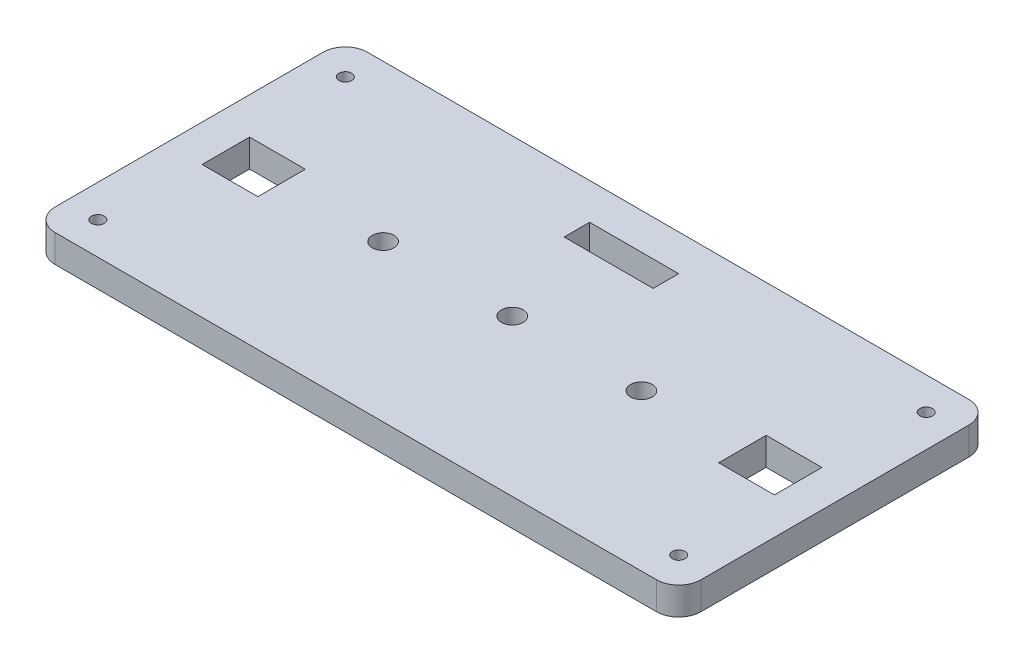
ISO-10303-21;
HEADER;
FILE_DESCRIPTION(('STEP AP214'),'2;1');
FILE_NAME('part.step','',(''),(''),'','','');
FILE_SCHEMA(('AUTOMOTIVE_DESIGN { 1 0 10303 214 1 1 1 1 }'));
ENDSEC;
DATA;
#1=APPLICATION_CONTEXT('core data for automotive mechanical design processes');
#2=APPLICATION_PROTOCOL_DEFINITION('international standard','automotive_design',2000,#1);
#3=PRODUCT_CONTEXT('',#1,'mechanical');
#4=PRODUCT('Part','Part','',(#3));
#5=PRODUCT_RELATED_PRODUCT_CATEGORY('part','',(#4));
#6=PRODUCT_DEFINITION_FORMATION('','',#4);
#7=PRODUCT_DEFINITION_CONTEXT('part definition',#1,'design');
#8=PRODUCT_DEFINITION('design','',#6,#7);
#9=PRODUCT_DEFINITION_SHAPE('','',#8);
#10=(LENGTH_UNIT() NAMED_UNIT(*) SI_UNIT(.MILLI.,.METRE.));
#11=(NAMED_UNIT(*) PLANE_ANGLE_UNIT() SI_UNIT($,.RADIAN.));
#12=(NAMED_UNIT(*) SI_UNIT($,.STERADIAN.) SOLID_ANGLE_UNIT());
#13=UNCERTAINTY_MEASURE_WITH_UNIT(LENGTH_MEASURE(1.E-05),#10,'distance_accuracy_value','');
#14=(GEOMETRIC_REPRESENTATION_CONTEXT(3) GLOBAL_UNCERTAINTY_ASSIGNED_CONTEXT((#13)) GLOBAL_UNIT_ASSIGNED_CONTEXT((#10,
#11,#12)) REPRESENTATION_CONTEXT('',''));
#15=CARTESIAN_POINT('',(0.,0.,0.));
#16=DIRECTION('',(0.,0.,1.));
#17=DIRECTION('',(1.,0.,0.));
#18=AXIS2_PLACEMENT_3D('',#15,#16,#17);
#19=CARTESIAN_POINT('',(73.914,6.35,35.7505));
#20=DIRECTION('',(-1.,0.,0.));
#21=DIRECTION('',(0.,0.,1.));
#22=AXIS2_PLACEMENT_3D('',#19,#20,#21);
#23=PLANE('',#22);
#24=DIRECTION('',(0.,0.,-1.));
#25=VECTOR('',#24,1.);
#26=CARTESIAN_POINT('',(73.914,6.35,35.7505));
#27=LINE('',#26,#25);
#28=CARTESIAN_POINT('',(73.914,6.35,30.6705));
#29=VERTEX_POINT('',#28);
#30=CARTESIAN_POINT('',(73.914,6.35,-30.6705));
#31=VERTEX_POINT('',#30);
#32=EDGE_CURVE('E313',#29,#31,#27,.T.);
#33=ORIENTED_EDGE('',*,*,#32,.F.);
#34=DIRECTION('',(0.,-1.,0.));
#35=VECTOR('',#34,1.);
#36=CARTESIAN_POINT('',(73.914,6.35,30.6705));
#37=LINE('',#36,#35);
#38=CARTESIAN_POINT('',(73.914,0.,30.6705));
#39=VERTEX_POINT('',#38);
#40=EDGE_CURVE('E364',#29,#39,#37,.T.);
#41=ORIENTED_EDGE('',*,*,#40,.T.);
#42=DIRECTION('',(0.,0.,-1.));
#43=VECTOR('',#42,1.);
#44=CARTESIAN_POINT('',(73.914,0.,35.7505));
#45=LINE('',#44,#43);
#46=CARTESIAN_POINT('',(73.914,0.,-30.6705));
#47=VERTEX_POINT('',#46);
#48=EDGE_CURVE('E306',#39,#47,#45,.T.);
#49=ORIENTED_EDGE('',*,*,#48,.T.);
#50=DIRECTION('',(0.,-1.,0.));
#51=VECTOR('',#50,1.);
#52=CARTESIAN_POINT('',(73.914,6.35,-30.6705));
#53=LINE('',#52,#51);
#54=EDGE_CURVE('E362',#47,#31,#53,.F.);
#55=ORIENTED_EDGE('',*,*,#54,.T.);
#56=EDGE_LOOP('',(#33,#41,#49,#55));
#57=FACE_BOUND('',#56,.T.);
#58=ADVANCED_FACE('F33',(#57),#23,.F.);
#59=CARTESIAN_POINT('',(-73.914,6.35,-35.7505));
#60=DIRECTION('',(0.,0.,1.));
#61=DIRECTION('',(1.,0.,0.));
#62=AXIS2_PLACEMENT_3D('',#59,#60,#61);
#63=PLANE('',#62);
#64=DIRECTION('',(-1.,0.,0.));
#65=VECTOR('',#64,1.);
#66=CARTESIAN_POINT('',(-73.914,6.35,-35.7505));
#67=LINE('',#66,#65);
#68=CARTESIAN_POINT('',(68.8339999999999,6.35,-35.7505));
#69=VERTEX_POINT('',#68);
#70=CARTESIAN_POINT('',(-68.834,6.35,-35.7505));
#71=VERTEX_POINT('',#70);
#72=EDGE_CURVE('E316',#69,#71,#67,.T.);
#73=ORIENTED_EDGE('',*,*,#72,.F.);
#74=DIRECTION('',(0.,-1.,0.));
#75=VECTOR('',#74,1.);
#76=CARTESIAN_POINT('',(68.834,6.35,-35.7505));
#77=LINE('',#76,#75);
#78=CARTESIAN_POINT('',(68.8339999999999,0.,-35.7505));
#79=VERTEX_POINT('',#78);
#80=EDGE_CURVE('E11',#69,#79,#77,.T.);
#81=ORIENTED_EDGE('',*,*,#80,.T.);
#82=DIRECTION('',(-1.,0.,0.));
#83=VECTOR('',#82,1.);
#84=CARTESIAN_POINT('',(-73.914,0.,-35.7505));
#85=LINE('',#84,#83);
#86=CARTESIAN_POINT('',(-68.834,0.,-35.7505));
#87=VERTEX_POINT('',#86);
#88=EDGE_CURVE('E329',#79,#87,#85,.T.);
#89=ORIENTED_EDGE('',*,*,#88,.T.);
#90=DIRECTION('',(0.,-1.,0.));
#91=VECTOR('',#90,1.);
#92=CARTESIAN_POINT('',(-68.834,6.35,-35.7505));
#93=LINE('',#92,#91);
#94=EDGE_CURVE('E41',#87,#71,#93,.F.);
#95=ORIENTED_EDGE('',*,*,#94,.T.);
#96=EDGE_LOOP('',(#73,#81,#89,#95));
#97=FACE_BOUND('',#96,.T.);
#98=ADVANCED_FACE('F369',(#97),#63,.F.);
#99=CARTESIAN_POINT('',(-73.914,6.35,35.7505));
#100=DIRECTION('',(1.,0.,0.));
#101=DIRECTION('',(0.,0.,-1.));
#102=AXIS2_PLACEMENT_3D('',#99,#100,#101);
#103=PLANE('',#102);
#104=DIRECTION('',(0.,0.,1.));
#105=VECTOR('',#104,1.);
#106=CARTESIAN_POINT('',(-73.914,0.,35.7505));
#107=LINE('',#106,#105);
#108=CARTESIAN_POINT('',(-73.914,0.,-30.6705));
#109=VERTEX_POINT('',#108);
#110=CARTESIAN_POINT('',(-73.914,0.,30.6705));
#111=VERTEX_POINT('',#110);
#112=EDGE_CURVE('E332',#109,#111,#107,.T.);
#113=ORIENTED_EDGE('',*,*,#112,.T.);
#114=DIRECTION('',(0.,-1.,0.));
#115=VECTOR('',#114,1.);
#116=CARTESIAN_POINT('',(-73.914,6.35,30.6705));
#117=LINE('',#116,#115);
#118=CARTESIAN_POINT('',(-73.914,6.35,30.6705));
#119=VERTEX_POINT('',#118);
#120=EDGE_CURVE('E352',#111,#119,#117,.F.);
#121=ORIENTED_EDGE('',*,*,#120,.T.);
#122=DIRECTION('',(0.,0.,1.));
#123=VECTOR('',#122,1.);
#124=CARTESIAN_POINT('',(-73.914,6.35,35.7505));
#125=LINE('',#124,#123);
#126=CARTESIAN_POINT('',(-73.914,6.35,-30.6705));
#127=VERTEX_POINT('',#126);
#128=EDGE_CURVE('E320',#127,#119,#125,.T.);
#129=ORIENTED_EDGE('',*,*,#128,.F.);
#130=DIRECTION('',(0.,-1.,0.));
#131=VECTOR('',#130,1.);
#132=CARTESIAN_POINT('',(-73.914,6.35,-30.6705));
#133=LINE('',#132,#131);
#134=EDGE_CURVE('E349',#127,#109,#133,.T.);
#135=ORIENTED_EDGE('',*,*,#134,.T.);
#136=EDGE_LOOP('',(#113,#121,#129,#135));
#137=FACE_BOUND('',#136,.T.);
#138=ADVANCED_FACE('F381',(#137),#103,.F.);
#139=CARTESIAN_POINT('',(-73.914,6.35,35.7505));
#140=DIRECTION('',(0.,0.,-1.));
#141=DIRECTION('',(-1.,0.,0.));
#142=AXIS2_PLACEMENT_3D('',#139,#140,#141);
#143=PLANE('',#142);
#144=DIRECTION('',(1.,0.,0.));
#145=VECTOR('',#144,1.);
#146=CARTESIAN_POINT('',(-73.914,6.35,35.7505));
#147=LINE('',#146,#145);
#148=CARTESIAN_POINT('',(-68.834,6.35,35.7505));
#149=VERTEX_POINT('',#148);
#150=CARTESIAN_POINT('',(68.8339999999999,6.35,35.7505));
#151=VERTEX_POINT('',#150);
#152=EDGE_CURVE('E323',#149,#151,#147,.T.);
#153=ORIENTED_EDGE('',*,*,#152,.F.);
#154=DIRECTION('',(0.,-1.,0.));
#155=VECTOR('',#154,1.);
#156=CARTESIAN_POINT('',(-68.834,6.35,35.7505));
#157=LINE('',#156,#155);
#158=CARTESIAN_POINT('',(-68.834,0.,35.7505));
#159=VERTEX_POINT('',#158);
#160=EDGE_CURVE('E338',#149,#159,#157,.T.);
#161=ORIENTED_EDGE('',*,*,#160,.T.);
#162=DIRECTION('',(1.,0.,0.));
#163=VECTOR('',#162,1.);
#164=CARTESIAN_POINT('',(-73.914,0.,35.7505));
#165=LINE('',#164,#163);
#166=CARTESIAN_POINT('',(68.8339999999999,0.,35.7505));
#167=VERTEX_POINT('',#166);
#168=EDGE_CURVE('E317',#159,#167,#165,.T.);
#169=ORIENTED_EDGE('',*,*,#168,.T.);
#170=DIRECTION('',(0.,-1.,0.));
#171=VECTOR('',#170,1.);
#172=CARTESIAN_POINT('',(68.834,6.35,35.7505));
#173=LINE('',#172,#171);
#174=EDGE_CURVE('E326',#167,#151,#173,.F.);
#175=ORIENTED_EDGE('',*,*,#174,.T.);
#176=EDGE_LOOP('',(#153,#161,#169,#175));
#177=FACE_BOUND('',#176,.T.);
#178=ADVANCED_FACE('F391',(#177),#143,.F.);
#179=CARTESIAN_POINT('',(0.,6.35,0.));
#180=DIRECTION('',(0.,-1.,0.));
#181=DIRECTION('',(0.,0.,-1.));
#182=AXIS2_PLACEMENT_3D('',#179,#180,#181);
#183=PLANE('',#182);
#184=DIRECTION('',(1.,0.,0.));
#185=VECTOR('',#184,1.);
#186=CARTESIAN_POINT('',(-9.6969347678928,6.35,-21.6259110331476));
#187=LINE('',#186,#185);
#188=CARTESIAN_POINT('',(-9.6969347678928,6.35,-21.6259110331476));
#189=VERTEX_POINT('',#188);
#190=CARTESIAN_POINT('',(10.6946890166641,6.35,-21.6259110331476));
#191=VERTEX_POINT('',#190);
#192=EDGE_CURVE('E197',#189,#191,#187,.T.);
#193=ORIENTED_EDGE('',*,*,#192,.F.);
#194=DIRECTION('',(0.,0.,1.));
#195=VECTOR('',#194,1.);
#196=CARTESIAN_POINT('',(-9.6969347678928,6.35,-27.4638544537866));
#197=LINE('',#196,#195);
#198=CARTESIAN_POINT('',(-9.6969347678928,6.35,-27.4638544537866));
#199=VERTEX_POINT('',#198);
#200=EDGE_CURVE('E48',#199,#189,#197,.T.);
#201=ORIENTED_EDGE('',*,*,#200,.F.);
#202=DIRECTION('',(-1.,0.,0.));
#203=VECTOR('',#202,1.);
#204=CARTESIAN_POINT('',(-9.6969347678928,6.35,-27.4638544537866));
#205=LINE('',#204,#203);
#206=CARTESIAN_POINT('',(10.6946890166641,6.35,-27.4638544537866));
#207=VERTEX_POINT('',#206);
#208=EDGE_CURVE('E188',#207,#199,#205,.T.);
#209=ORIENTED_EDGE('',*,*,#208,.F.);
#210=DIRECTION('',(0.,0.,-1.));
#211=VECTOR('',#210,1.);
#212=CARTESIAN_POINT('',(10.6946890166641,6.35,-27.4638544537866));
#213=LINE('',#212,#211);
#214=EDGE_CURVE('E191',#191,#207,#213,.T.);
#215=ORIENTED_EDGE('',*,*,#214,.F.);
#216=EDGE_LOOP('',(#193,#201,#209,#215));
#217=FACE_BOUND('',#216,.T.);
#218=CARTESIAN_POINT('',(-66.4844999999999,6.35,28.321));
#219=DIRECTION('',(0.,1.,0.));
#220=DIRECTION('',(0.,0.,-1.));
#221=AXIS2_PLACEMENT_3D('',#218,#219,#220);
#222=CIRCLE('',#221,1.4605);
#223=CARTESIAN_POINT('',(-66.4844999999999,6.35,26.8605));
#224=VERTEX_POINT('',#223);
#225=EDGE_CURVE('E203',#224,#224,#222,.T.);
#226=ORIENTED_EDGE('',*,*,#225,.F.);
#227=EDGE_LOOP('',(#226));
#228=FACE_BOUND('',#227,.T.);
#229=CARTESIAN_POINT('',(66.4844999999999,6.35,28.321));
#230=DIRECTION('',(0.,1.,0.));
#231=DIRECTION('',(0.,0.,1.));
#232=AXIS2_PLACEMENT_3D('',#229,#230,#231);
#233=CIRCLE('',#232,1.46049999999999);
#234=CARTESIAN_POINT('',(66.4844999999999,6.35,29.7815));
#235=VERTEX_POINT('',#234);
#236=EDGE_CURVE('E210',#235,#235,#233,.T.);
#237=ORIENTED_EDGE('',*,*,#236,.F.);
#238=EDGE_LOOP('',(#237));
#239=FACE_BOUND('',#238,.T.);
#240=CARTESIAN_POINT('',(66.4844999999999,6.35,-28.321));
#241=DIRECTION('',(0.,1.,0.));
#242=DIRECTION('',(0.,0.,-1.));
#243=AXIS2_PLACEMENT_3D('',#240,#241,#242);
#244=CIRCLE('',#243,1.4605);
#245=CARTESIAN_POINT('',(66.4844999999999,6.35,-29.7815));
#246=VERTEX_POINT('',#245);
#247=EDGE_CURVE('E216',#246,#246,#244,.T.);
#248=ORIENTED_EDGE('',*,*,#247,.F.);
#249=EDGE_LOOP('',(#248));
#250=FACE_BOUND('',#249,.T.);
#251=CARTESIAN_POINT('',(-66.4845,6.35,-28.321));
#252=DIRECTION('',(0.,1.,0.));
#253=DIRECTION('',(0.,0.,1.));
#254=AXIS2_PLACEMENT_3D('',#251,#252,#253);
#255=CIRCLE('',#254,1.4605);
#256=CARTESIAN_POINT('',(-66.4845,6.35,-26.8605));
#257=VERTEX_POINT('',#256);
#258=EDGE_CURVE('E222',#257,#257,#255,.T.);
#259=ORIENTED_EDGE('',*,*,#258,.F.);
#260=EDGE_LOOP('',(#259));
#261=FACE_BOUND('',#260,.T.);
#262=CARTESIAN_POINT('',(0.0598685872428284,6.35,0.));
#263=DIRECTION('',(0.,1.,0.));
#264=DIRECTION('',(0.,0.,1.));
#265=AXIS2_PLACEMENT_3D('',#262,#263,#264);
#266=CIRCLE('',#265,2.4892);
#267=CARTESIAN_POINT('',(0.0598685872428284,6.35,2.48919999999999));
#268=VERTEX_POINT('',#267);
#269=EDGE_CURVE('E228',#268,#268,#266,.T.);
#270=ORIENTED_EDGE('',*,*,#269,.F.);
#271=EDGE_LOOP('',(#270));
#272=FACE_BOUND('',#271,.T.);
#273=CARTESIAN_POINT('',(29.6254685872428,6.35,0.));
#274=DIRECTION('',(0.,1.,0.));
#275=DIRECTION('',(0.,0.,1.));
#276=AXIS2_PLACEMENT_3D('',#273,#274,#275);
#277=CIRCLE('',#276,2.4892);
#278=CARTESIAN_POINT('',(29.6254685872428,6.35,2.48919999999999));
#279=VERTEX_POINT('',#278);
#280=EDGE_CURVE('E234',#279,#279,#277,.T.);
#281=ORIENTED_EDGE('',*,*,#280,.F.);
#282=EDGE_LOOP('',(#281));
#283=FACE_BOUND('',#282,.T.);
#284=CARTESIAN_POINT('',(-29.5057314127572,6.35,0.));
#285=DIRECTION('',(0.,1.,0.));
#286=DIRECTION('',(0.,0.,1.));
#287=AXIS2_PLACEMENT_3D('',#284,#285,#286);
#288=CIRCLE('',#287,2.4892);
#289=CARTESIAN_POINT('',(-29.5057314127572,6.35,2.48919999999999));
#290=VERTEX_POINT('',#289);
#291=EDGE_CURVE('E240',#290,#290,#288,.T.);
#292=ORIENTED_EDGE('',*,*,#291,.F.);
#293=EDGE_LOOP('',(#292));
#294=FACE_BOUND('',#293,.T.);
#295=DIRECTION('',(1.,0.,0.));
#296=VECTOR('',#295,1.);
#297=CARTESIAN_POINT('',(-65.5066,6.35,5.4356));
#298=LINE('',#297,#296);
#299=CARTESIAN_POINT('',(-65.5066,6.35,5.4356));
#300=VERTEX_POINT('',#299);
#301=CARTESIAN_POINT('',(-52.7558,6.35,5.4356));
#302=VERTEX_POINT('',#301);
#303=EDGE_CURVE('E264',#300,#302,#298,.T.);
#304=ORIENTED_EDGE('',*,*,#303,.F.);
#305=DIRECTION('',(0.,0.,1.));
#306=VECTOR('',#305,1.);
#307=CARTESIAN_POINT('',(-65.5066,6.35,-5.4356));
#308=LINE('',#307,#306);
#309=CARTESIAN_POINT('',(-65.5066,6.35,-5.4356));
#310=VERTEX_POINT('',#309);
#311=EDGE_CURVE('E246',#310,#300,#308,.T.);
#312=ORIENTED_EDGE('',*,*,#311,.F.);
#313=DIRECTION('',(-1.,0.,0.));
#314=VECTOR('',#313,1.);
#315=CARTESIAN_POINT('',(-65.5066,6.35,-5.4356));
#316=LINE('',#315,#314);
#317=CARTESIAN_POINT('',(-52.7558,6.35,-5.4356));
#318=VERTEX_POINT('',#317);
#319=EDGE_CURVE('E253',#318,#310,#316,.T.);
#320=ORIENTED_EDGE('',*,*,#319,.F.);
#321=DIRECTION('',(0.,0.,-1.));
#322=VECTOR('',#321,1.);
#323=CARTESIAN_POINT('',(-52.7558,6.35,-5.4356));
#324=LINE('',#323,#322);
#325=EDGE_CURVE('E267',#302,#318,#324,.T.);
#326=ORIENTED_EDGE('',*,*,#325,.F.);
#327=EDGE_LOOP('',(#304,#312,#320,#326));
#328=FACE_BOUND('',#327,.T.);
#329=DIRECTION('',(1.,0.,0.));
#330=VECTOR('',#329,1.);
#331=CARTESIAN_POINT('',(52.7558,6.35,5.43559999999999));
#332=LINE('',#331,#330);
#333=CARTESIAN_POINT('',(52.7558,6.35,5.43559999999999));
#334=VERTEX_POINT('',#333);
#335=CARTESIAN_POINT('',(65.5066,6.35,5.43559999999999));
#336=VERTEX_POINT('',#335);
#337=EDGE_CURVE('E296',#334,#336,#332,.T.);
#338=ORIENTED_EDGE('',*,*,#337,.F.);
#339=DIRECTION('',(0.,0.,1.));
#340=VECTOR('',#339,1.);
#341=CARTESIAN_POINT('',(52.7558,6.35,-5.43560000000001));
#342=LINE('',#341,#340);
#343=CARTESIAN_POINT('',(52.7558,6.35,-5.43560000000001));
#344=VERTEX_POINT('',#343);
#345=EDGE_CURVE('E274',#344,#334,#342,.T.);
#346=ORIENTED_EDGE('',*,*,#345,.F.);
#347=DIRECTION('',(-1.,0.,0.));
#348=VECTOR('',#347,1.);
#349=CARTESIAN_POINT('',(52.7558,6.35,-5.43560000000001));
#350=LINE('',#349,#348);
#351=CARTESIAN_POINT('',(65.5066,6.35,-5.43560000000001));
#352=VERTEX_POINT('',#351);
#353=EDGE_CURVE('E285',#352,#344,#350,.T.);
#354=ORIENTED_EDGE('',*,*,#353,.F.);
#355=DIRECTION('',(0.,0.,-1.));
#356=VECTOR('',#355,1.);
#357=CARTESIAN_POINT('',(65.5066,6.35,-5.43560000000001));
#358=LINE('',#357,#356);
#359=EDGE_CURVE('E299',#336,#352,#358,.T.);
#360=ORIENTED_EDGE('',*,*,#359,.F.);
#361=EDGE_LOOP('',(#338,#346,#354,#360));
#362=FACE_BOUND('',#361,.T.);
#363=ORIENTED_EDGE('',*,*,#128,.T.);
#364=CARTESIAN_POINT('',(-68.834,6.35,30.6705));
#365=DIRECTION('',(0.,-1.,0.));
#366=DIRECTION('',(0.,0.,-1.));
#367=AXIS2_PLACEMENT_3D('',#364,#365,#366);
#368=CIRCLE('',#367,5.08);
#369=EDGE_CURVE('E360',#119,#149,#368,.F.);
#370=ORIENTED_EDGE('',*,*,#369,.T.);
#371=ORIENTED_EDGE('',*,*,#152,.T.);
#372=CARTESIAN_POINT('',(68.834,6.35,30.6705));
#373=DIRECTION('',(0.,-1.,0.));
#374=DIRECTION('',(0.,0.,-1.));
#375=AXIS2_PLACEMENT_3D('',#372,#373,#374);
#376=CIRCLE('',#375,5.08);
#377=EDGE_CURVE('E358',#151,#29,#376,.F.);
#378=ORIENTED_EDGE('',*,*,#377,.T.);
#379=ORIENTED_EDGE('',*,*,#32,.T.);
#380=CARTESIAN_POINT('',(68.834,6.35,-30.6705));
#381=DIRECTION('',(0.,-1.,0.));
#382=DIRECTION('',(0.,0.,-1.));
#383=AXIS2_PLACEMENT_3D('',#380,#381,#382);
#384=CIRCLE('',#383,5.08);
#385=EDGE_CURVE('E356',#31,#69,#384,.F.);
#386=ORIENTED_EDGE('',*,*,#385,.T.);
#387=ORIENTED_EDGE('',*,*,#72,.T.);
#388=CARTESIAN_POINT('',(-68.834,6.35,-30.6705));
#389=DIRECTION('',(0.,-1.,0.));
#390=DIRECTION('',(0.,0.,-1.));
#391=AXIS2_PLACEMENT_3D('',#388,#389,#390);
#392=CIRCLE('',#391,5.08);
#393=EDGE_CURVE('E354',#71,#127,#392,.F.);
#394=ORIENTED_EDGE('',*,*,#393,.T.);
#395=EDGE_LOOP('',(#363,#370,#371,#378,#379,#386,#387,#394));
#396=FACE_BOUND('',#395,.T.);
#397=ADVANCED_FACE('F375',(#217,#228,#239,#250,#261,#272,#283,#294,#328,#362,#396),#183,.F.);
#398=CARTESIAN_POINT('',(0.,0.,0.));
#399=DIRECTION('',(0.,-1.,0.));
#400=DIRECTION('',(0.,0.,-1.));
#401=AXIS2_PLACEMENT_3D('',#398,#399,#400);
#402=PLANE('',#401);
#403=DIRECTION('',(0.,0.,1.));
#404=VECTOR('',#403,1.);
#405=CARTESIAN_POINT('',(-9.6969347678928,0.,-27.4638544537866));
#406=LINE('',#405,#404);
#407=CARTESIAN_POINT('',(-9.6969347678928,0.,-27.4638544537866));
#408=VERTEX_POINT('',#407);
#409=CARTESIAN_POINT('',(-9.6969347678928,0.,-21.6259110331476));
#410=VERTEX_POINT('',#409);
#411=EDGE_CURVE('E172',#408,#410,#406,.T.);
#412=ORIENTED_EDGE('',*,*,#411,.T.);
#413=DIRECTION('',(1.,0.,0.));
#414=VECTOR('',#413,1.);
#415=CARTESIAN_POINT('',(-9.6969347678928,0.,-21.6259110331476));
#416=LINE('',#415,#414);
#417=CARTESIAN_POINT('',(10.6946890166641,0.,-21.6259110331476));
#418=VERTEX_POINT('',#417);
#419=EDGE_CURVE('E181',#410,#418,#416,.T.);
#420=ORIENTED_EDGE('',*,*,#419,.T.);
#421=DIRECTION('',(0.,0.,-1.));
#422=VECTOR('',#421,1.);
#423=CARTESIAN_POINT('',(10.6946890166641,0.,-27.4638544537866));
#424=LINE('',#423,#422);
#425=CARTESIAN_POINT('',(10.6946890166641,0.,-27.4638544537866));
#426=VERTEX_POINT('',#425);
#427=EDGE_CURVE('E56',#418,#426,#424,.T.);
#428=ORIENTED_EDGE('',*,*,#427,.T.);
#429=DIRECTION('',(-1.,0.,0.));
#430=VECTOR('',#429,1.);
#431=CARTESIAN_POINT('',(-9.6969347678928,0.,-27.4638544537866));
#432=LINE('',#431,#430);
#433=EDGE_CURVE('E178',#426,#408,#432,.T.);
#434=ORIENTED_EDGE('',*,*,#433,.T.);
#435=EDGE_LOOP('',(#412,#420,#428,#434));
#436=FACE_BOUND('',#435,.T.);
#437=CARTESIAN_POINT('',(-66.4844999999999,0.,28.321));
#438=DIRECTION('',(0.,1.,0.));
#439=DIRECTION('',(0.,0.,-1.));
#440=AXIS2_PLACEMENT_3D('',#437,#438,#439);
#441=CIRCLE('',#440,1.4605);
#442=CARTESIAN_POINT('',(-66.4844999999999,0.,26.8605));
#443=VERTEX_POINT('',#442);
#444=EDGE_CURVE('E207',#443,#443,#441,.T.);
#445=ORIENTED_EDGE('',*,*,#444,.T.);
#446=EDGE_LOOP('',(#445));
#447=FACE_BOUND('',#446,.T.);
#448=CARTESIAN_POINT('',(66.4844999999999,0.,28.321));
#449=DIRECTION('',(0.,1.,0.));
#450=DIRECTION('',(0.,0.,1.));
#451=AXIS2_PLACEMENT_3D('',#448,#449,#450);
#452=CIRCLE('',#451,1.46049999999999);
#453=CARTESIAN_POINT('',(66.4844999999999,0.,29.7815));
#454=VERTEX_POINT('',#453);
#455=EDGE_CURVE('E213',#454,#454,#452,.T.);
#456=ORIENTED_EDGE('',*,*,#455,.T.);
#457=EDGE_LOOP('',(#456));
#458=FACE_BOUND('',#457,.T.);
#459=CARTESIAN_POINT('',(66.4844999999999,0.,-28.321));
#460=DIRECTION('',(0.,1.,0.));
#461=DIRECTION('',(0.,0.,-1.));
#462=AXIS2_PLACEMENT_3D('',#459,#460,#461);
#463=CIRCLE('',#462,1.4605);
#464=CARTESIAN_POINT('',(66.4844999999999,0.,-29.7815));
#465=VERTEX_POINT('',#464);
#466=EDGE_CURVE('E219',#465,#465,#463,.T.);
#467=ORIENTED_EDGE('',*,*,#466,.T.);
#468=EDGE_LOOP('',(#467));
#469=FACE_BOUND('',#468,.T.);
#470=CARTESIAN_POINT('',(-66.4845,0.,-28.321));
#471=DIRECTION('',(0.,1.,0.));
#472=DIRECTION('',(0.,0.,1.));
#473=AXIS2_PLACEMENT_3D('',#470,#471,#472);
#474=CIRCLE('',#473,1.4605);
#475=CARTESIAN_POINT('',(-66.4845,0.,-26.8605));
#476=VERTEX_POINT('',#475);
#477=EDGE_CURVE('E225',#476,#476,#474,.T.);
#478=ORIENTED_EDGE('',*,*,#477,.T.);
#479=EDGE_LOOP('',(#478));
#480=FACE_BOUND('',#479,.T.);
#481=CARTESIAN_POINT('',(0.0598685872428284,0.,0.));
#482=DIRECTION('',(0.,1.,0.));
#483=DIRECTION('',(0.,0.,1.));
#484=AXIS2_PLACEMENT_3D('',#481,#482,#483);
#485=CIRCLE('',#484,2.4892);
#486=CARTESIAN_POINT('',(0.0598685872428284,0.,2.48919999999999));
#487=VERTEX_POINT('',#486);
#488=EDGE_CURVE('E231',#487,#487,#485,.T.);
#489=ORIENTED_EDGE('',*,*,#488,.T.);
#490=EDGE_LOOP('',(#489));
#491=FACE_BOUND('',#490,.T.);
#492=CARTESIAN_POINT('',(29.6254685872428,0.,0.));
#493=DIRECTION('',(0.,1.,0.));
#494=DIRECTION('',(0.,0.,1.));
#495=AXIS2_PLACEMENT_3D('',#492,#493,#494);
#496=CIRCLE('',#495,2.4892);
#497=CARTESIAN_POINT('',(29.6254685872428,0.,2.48919999999999));
#498=VERTEX_POINT('',#497);
#499=EDGE_CURVE('E237',#498,#498,#496,.T.);
#500=ORIENTED_EDGE('',*,*,#499,.T.);
#501=EDGE_LOOP('',(#500));
#502=FACE_BOUND('',#501,.T.);
#503=CARTESIAN_POINT('',(-29.5057314127572,0.,0.));
#504=DIRECTION('',(0.,1.,0.));
#505=DIRECTION('',(0.,0.,1.));
#506=AXIS2_PLACEMENT_3D('',#503,#504,#505);
#507=CIRCLE('',#506,2.4892);
#508=CARTESIAN_POINT('',(-29.5057314127572,0.,2.48919999999999));
#509=VERTEX_POINT('',#508);
#510=EDGE_CURVE('E243',#509,#509,#507,.T.);
#511=ORIENTED_EDGE('',*,*,#510,.T.);
#512=EDGE_LOOP('',(#511));
#513=FACE_BOUND('',#512,.T.);
#514=DIRECTION('',(0.,0.,1.));
#515=VECTOR('',#514,1.);
#516=CARTESIAN_POINT('',(-65.5066,0.,-5.4356));
#517=LINE('',#516,#515);
#518=CARTESIAN_POINT('',(-65.5066,0.,-5.4356));
#519=VERTEX_POINT('',#518);
#520=CARTESIAN_POINT('',(-65.5066,0.,5.4356));
#521=VERTEX_POINT('',#520);
#522=EDGE_CURVE('E249',#519,#521,#517,.T.);
#523=ORIENTED_EDGE('',*,*,#522,.T.);
#524=DIRECTION('',(1.,0.,0.));
#525=VECTOR('',#524,1.);
#526=CARTESIAN_POINT('',(-65.5066,0.,5.4356));
#527=LINE('',#526,#525);
#528=CARTESIAN_POINT('',(-52.7558,0.,5.4356));
#529=VERTEX_POINT('',#528);
#530=EDGE_CURVE('E252',#521,#529,#527,.T.);
#531=ORIENTED_EDGE('',*,*,#530,.T.);
#532=DIRECTION('',(0.,0.,-1.));
#533=VECTOR('',#532,1.);
#534=CARTESIAN_POINT('',(-52.7558,0.,-5.4356));
#535=LINE('',#534,#533);
#536=CARTESIAN_POINT('',(-52.7558,0.,-5.4356));
#537=VERTEX_POINT('',#536);
#538=EDGE_CURVE('E256',#529,#537,#535,.T.);
#539=ORIENTED_EDGE('',*,*,#538,.T.);
#540=DIRECTION('',(-1.,0.,0.));
#541=VECTOR('',#540,1.);
#542=CARTESIAN_POINT('',(-65.5066,0.,-5.4356));
#543=LINE('',#542,#541);
#544=EDGE_CURVE('E259',#537,#519,#543,.T.);
#545=ORIENTED_EDGE('',*,*,#544,.T.);
#546=EDGE_LOOP('',(#523,#531,#539,#545));
#547=FACE_BOUND('',#546,.T.);
#548=DIRECTION('',(0.,0.,1.));
#549=VECTOR('',#548,1.);
#550=CARTESIAN_POINT('',(52.7558,0.,-5.43560000000001));
#551=LINE('',#550,#549);
#552=CARTESIAN_POINT('',(52.7558,0.,-5.43560000000001));
#553=VERTEX_POINT('',#552);
#554=CARTESIAN_POINT('',(52.7558,0.,5.43559999999999));
#555=VERTEX_POINT('',#554);
#556=EDGE_CURVE('E281',#553,#555,#551,.T.);
#557=ORIENTED_EDGE('',*,*,#556,.T.);
#558=DIRECTION('',(1.,0.,0.));
#559=VECTOR('',#558,1.);
#560=CARTESIAN_POINT('',(52.7558,0.,5.43559999999999));
#561=LINE('',#560,#559);
#562=CARTESIAN_POINT('',(65.5066,0.,5.43559999999999));
#563=VERTEX_POINT('',#562);
#564=EDGE_CURVE('E284',#555,#563,#561,.T.);
#565=ORIENTED_EDGE('',*,*,#564,.T.);
#566=DIRECTION('',(0.,0.,-1.));
#567=VECTOR('',#566,1.);
#568=CARTESIAN_POINT('',(65.5066,0.,-5.43560000000001));
#569=LINE('',#568,#567);
#570=CARTESIAN_POINT('',(65.5066,0.,-5.43560000000001));
#571=VERTEX_POINT('',#570);
#572=EDGE_CURVE('E288',#563,#571,#569,.T.);
#573=ORIENTED_EDGE('',*,*,#572,.T.);
#574=DIRECTION('',(-1.,0.,0.));
#575=VECTOR('',#574,1.);
#576=CARTESIAN_POINT('',(52.7558,0.,-5.43560000000001));
#577=LINE('',#576,#575);
#578=EDGE_CURVE('E291',#571,#553,#577,.T.);
#579=ORIENTED_EDGE('',*,*,#578,.T.);
#580=EDGE_LOOP('',(#557,#565,#573,#579));
#581=FACE_BOUND('',#580,.T.);
#582=ORIENTED_EDGE('',*,*,#168,.F.);
#583=CARTESIAN_POINT('',(-68.834,0.,30.6705));
#584=DIRECTION('',(0.,-1.,0.));
#585=DIRECTION('',(0.,0.,-1.));
#586=AXIS2_PLACEMENT_3D('',#583,#584,#585);
#587=CIRCLE('',#586,5.08);
#588=EDGE_CURVE('E347',#159,#111,#587,.T.);
#589=ORIENTED_EDGE('',*,*,#588,.T.);
#590=ORIENTED_EDGE('',*,*,#112,.F.);
#591=CARTESIAN_POINT('',(-68.834,0.,-30.6705));
#592=DIRECTION('',(0.,-1.,0.));
#593=DIRECTION('',(0.,0.,-1.));
#594=AXIS2_PLACEMENT_3D('',#591,#592,#593);
#595=CIRCLE('',#594,5.08);
#596=EDGE_CURVE('E341',#109,#87,#595,.T.);
#597=ORIENTED_EDGE('',*,*,#596,.T.);
#598=ORIENTED_EDGE('',*,*,#88,.F.);
#599=CARTESIAN_POINT('',(68.834,0.,-30.6705));
#600=DIRECTION('',(0.,-1.,0.));
#601=DIRECTION('',(0.,0.,-1.));
#602=AXIS2_PLACEMENT_3D('',#599,#600,#601);
#603=CIRCLE('',#602,5.08);
#604=EDGE_CURVE('E343',#79,#47,#603,.T.);
#605=ORIENTED_EDGE('',*,*,#604,.T.);
#606=ORIENTED_EDGE('',*,*,#48,.F.);
#607=CARTESIAN_POINT('',(68.834,0.,30.6705));
#608=DIRECTION('',(0.,-1.,0.));
#609=DIRECTION('',(0.,0.,-1.));
#610=AXIS2_PLACEMENT_3D('',#607,#608,#609);
#611=CIRCLE('',#610,5.08);
#612=EDGE_CURVE('E345',#39,#167,#611,.T.);
#613=ORIENTED_EDGE('',*,*,#612,.T.);
#614=EDGE_LOOP('',(#582,#589,#590,#597,#598,#605,#606,#613));
#615=FACE_BOUND('',#614,.T.);
#616=ADVANCED_FACE('F185',(#436,#447,#458,#469,#480,#491,#502,#513,#547,#581,#615),#402,.T.);
#617=CARTESIAN_POINT('',(-68.834,6.35,30.6705));
#618=DIRECTION('',(0.,-1.,0.));
#619=DIRECTION('',(0.,0.,-1.));
#620=AXIS2_PLACEMENT_3D('',#617,#618,#619);
#621=CYLINDRICAL_SURFACE('',#620,5.08);
#622=ORIENTED_EDGE('',*,*,#369,.F.);
#623=ORIENTED_EDGE('',*,*,#120,.F.);
#624=ORIENTED_EDGE('',*,*,#588,.F.);
#625=ORIENTED_EDGE('',*,*,#160,.F.);
#626=EDGE_LOOP('',(#622,#623,#624,#625));
#627=FACE_BOUND('',#626,.T.);
#628=ADVANCED_FACE('F388',(#627),#621,.T.);
#629=CARTESIAN_POINT('',(68.834,6.35,30.6705));
#630=DIRECTION('',(0.,-1.,0.));
#631=DIRECTION('',(0.,0.,-1.));
#632=AXIS2_PLACEMENT_3D('',#629,#630,#631);
#633=CYLINDRICAL_SURFACE('',#632,5.08);
#634=ORIENTED_EDGE('',*,*,#377,.F.);
#635=ORIENTED_EDGE('',*,*,#174,.F.);
#636=ORIENTED_EDGE('',*,*,#612,.F.);
#637=ORIENTED_EDGE('',*,*,#40,.F.);
#638=EDGE_LOOP('',(#634,#635,#636,#637));
#639=FACE_BOUND('',#638,.T.);
#640=ADVANCED_FACE('F397',(#639),#633,.T.);
#641=CARTESIAN_POINT('',(68.834,6.35,-30.6705));
#642=DIRECTION('',(0.,-1.,0.));
#643=DIRECTION('',(0.,0.,-1.));
#644=AXIS2_PLACEMENT_3D('',#641,#642,#643);
#645=CYLINDRICAL_SURFACE('',#644,5.08);
#646=ORIENTED_EDGE('',*,*,#385,.F.);
#647=ORIENTED_EDGE('',*,*,#54,.F.);
#648=ORIENTED_EDGE('',*,*,#604,.F.);
#649=ORIENTED_EDGE('',*,*,#80,.F.);
#650=EDGE_LOOP('',(#646,#647,#648,#649));
#651=FACE_BOUND('',#650,.T.);
#652=ADVANCED_FACE('F402',(#651),#645,.T.);
#653=CARTESIAN_POINT('',(-68.834,6.35,-30.6705));
#654=DIRECTION('',(0.,-1.,0.));
#655=DIRECTION('',(0.,0.,-1.));
#656=AXIS2_PLACEMENT_3D('',#653,#654,#655);
#657=CYLINDRICAL_SURFACE('',#656,5.08);
#658=ORIENTED_EDGE('',*,*,#393,.F.);
#659=ORIENTED_EDGE('',*,*,#94,.F.);
#660=ORIENTED_EDGE('',*,*,#596,.F.);
#661=ORIENTED_EDGE('',*,*,#134,.F.);
#662=EDGE_LOOP('',(#658,#659,#660,#661));
#663=FACE_BOUND('',#662,.T.);
#664=ADVANCED_FACE('F35',(#663),#657,.T.);
#665=CARTESIAN_POINT('',(52.7558,0.,-5.43560000000001));
#666=DIRECTION('',(-1.,0.,0.));
#667=DIRECTION('',(0.,0.,1.));
#668=AXIS2_PLACEMENT_3D('',#665,#666,#667);
#669=PLANE('',#668);
#670=ORIENTED_EDGE('',*,*,#345,.T.);
#671=DIRECTION('',(0.,1.,0.));
#672=VECTOR('',#671,1.);
#673=CARTESIAN_POINT('',(52.7558,0.,5.43559999999999));
#674=LINE('',#673,#672);
#675=EDGE_CURVE('E294',#555,#334,#674,.T.);
#676=ORIENTED_EDGE('',*,*,#675,.F.);
#677=ORIENTED_EDGE('',*,*,#556,.F.);
#678=DIRECTION('',(0.,1.,0.));
#679=VECTOR('',#678,1.);
#680=CARTESIAN_POINT('',(52.7558,0.,-5.43560000000001));
#681=LINE('',#680,#679);
#682=EDGE_CURVE('E304',#553,#344,#681,.T.);
#683=ORIENTED_EDGE('',*,*,#682,.T.);
#684=EDGE_LOOP('',(#670,#676,#677,#683));
#685=FACE_BOUND('',#684,.T.);
#686=ADVANCED_FACE('F408',(#685),#669,.F.);
#687=CARTESIAN_POINT('',(52.7558,0.,-5.43560000000001));
#688=DIRECTION('',(0.,0.,-1.));
#689=DIRECTION('',(-1.,0.,0.));
#690=AXIS2_PLACEMENT_3D('',#687,#688,#689);
#691=PLANE('',#690);
#692=ORIENTED_EDGE('',*,*,#353,.T.);
#693=ORIENTED_EDGE('',*,*,#682,.F.);
#694=ORIENTED_EDGE('',*,*,#578,.F.);
#695=DIRECTION('',(0.,1.,0.));
#696=VECTOR('',#695,1.);
#697=CARTESIAN_POINT('',(65.5066,0.,-5.43560000000001));
#698=LINE('',#697,#696);
#699=EDGE_CURVE('E307',#571,#352,#698,.T.);
#700=ORIENTED_EDGE('',*,*,#699,.T.);
#701=EDGE_LOOP('',(#692,#693,#694,#700));
#702=FACE_BOUND('',#701,.T.);
#703=ADVANCED_FACE('F478',(#702),#691,.F.);
#704=CARTESIAN_POINT('',(65.5066,0.,-5.43560000000001));
#705=DIRECTION('',(1.,0.,0.));
#706=DIRECTION('',(0.,0.,-1.));
#707=AXIS2_PLACEMENT_3D('',#704,#705,#706);
#708=PLANE('',#707);
#709=ORIENTED_EDGE('',*,*,#359,.T.);
#710=ORIENTED_EDGE('',*,*,#699,.F.);
#711=ORIENTED_EDGE('',*,*,#572,.F.);
#712=DIRECTION('',(0.,1.,0.));
#713=VECTOR('',#712,1.);
#714=CARTESIAN_POINT('',(65.5066,0.,5.43559999999999));
#715=LINE('',#714,#713);
#716=EDGE_CURVE('E309',#563,#336,#715,.T.);
#717=ORIENTED_EDGE('',*,*,#716,.T.);
#718=EDGE_LOOP('',(#709,#710,#711,#717));
#719=FACE_BOUND('',#718,.T.);
#720=ADVANCED_FACE('F486',(#719),#708,.F.);
#721=CARTESIAN_POINT('',(52.7558,0.,5.43559999999999));
#722=DIRECTION('',(0.,0.,1.));
#723=DIRECTION('',(1.,0.,0.));
#724=AXIS2_PLACEMENT_3D('',#721,#722,#723);
#725=PLANE('',#724);
#726=ORIENTED_EDGE('',*,*,#337,.T.);
#727=ORIENTED_EDGE('',*,*,#716,.F.);
#728=ORIENTED_EDGE('',*,*,#564,.F.);
#729=ORIENTED_EDGE('',*,*,#675,.T.);
#730=EDGE_LOOP('',(#726,#727,#728,#729));
#731=FACE_BOUND('',#730,.T.);
#732=ADVANCED_FACE('F495',(#731),#725,.F.);
#733=CARTESIAN_POINT('',(-65.5066,0.,-5.4356));
#734=DIRECTION('',(-1.,0.,0.));
#735=DIRECTION('',(0.,0.,1.));
#736=AXIS2_PLACEMENT_3D('',#733,#734,#735);
#737=PLANE('',#736);
#738=ORIENTED_EDGE('',*,*,#311,.T.);
#739=DIRECTION('',(0.,1.,0.));
#740=VECTOR('',#739,1.);
#741=CARTESIAN_POINT('',(-65.5066,0.,5.4356));
#742=LINE('',#741,#740);
#743=EDGE_CURVE('E262',#521,#300,#742,.T.);
#744=ORIENTED_EDGE('',*,*,#743,.F.);
#745=ORIENTED_EDGE('',*,*,#522,.F.);
#746=DIRECTION('',(0.,1.,0.));
#747=VECTOR('',#746,1.);
#748=CARTESIAN_POINT('',(-65.5066,0.,-5.4356));
#749=LINE('',#748,#747);
#750=EDGE_CURVE('E272',#519,#310,#749,.T.);
#751=ORIENTED_EDGE('',*,*,#750,.T.);
#752=EDGE_LOOP('',(#738,#744,#745,#751));
#753=FACE_BOUND('',#752,.T.);
#754=ADVANCED_FACE('F504',(#753),#737,.F.);
#755=CARTESIAN_POINT('',(-65.5066,0.,-5.4356));
#756=DIRECTION('',(0.,0.,-1.));
#757=DIRECTION('',(-1.,0.,0.));
#758=AXIS2_PLACEMENT_3D('',#755,#756,#757);
#759=PLANE('',#758);
#760=ORIENTED_EDGE('',*,*,#319,.T.);
#761=ORIENTED_EDGE('',*,*,#750,.F.);
#762=ORIENTED_EDGE('',*,*,#544,.F.);
#763=DIRECTION('',(0.,1.,0.));
#764=VECTOR('',#763,1.);
#765=CARTESIAN_POINT('',(-52.7558,0.,-5.4356));
#766=LINE('',#765,#764);
#767=EDGE_CURVE('E275',#537,#318,#766,.T.);
#768=ORIENTED_EDGE('',*,*,#767,.T.);
#769=EDGE_LOOP('',(#760,#761,#762,#768));
#770=FACE_BOUND('',#769,.T.);
#771=ADVANCED_FACE('F513',(#770),#759,.F.);
#772=CARTESIAN_POINT('',(-52.7558,0.,-5.4356));
#773=DIRECTION('',(1.,0.,0.));
#774=DIRECTION('',(0.,0.,-1.));
#775=AXIS2_PLACEMENT_3D('',#772,#773,#774);
#776=PLANE('',#775);
#777=ORIENTED_EDGE('',*,*,#325,.T.);
#778=ORIENTED_EDGE('',*,*,#767,.F.);
#779=ORIENTED_EDGE('',*,*,#538,.F.);
#780=DIRECTION('',(0.,1.,0.));
#781=VECTOR('',#780,1.);
#782=CARTESIAN_POINT('',(-52.7558,0.,5.4356));
#783=LINE('',#782,#781);
#784=EDGE_CURVE('E277',#529,#302,#783,.T.);
#785=ORIENTED_EDGE('',*,*,#784,.T.);
#786=EDGE_LOOP('',(#777,#778,#779,#785));
#787=FACE_BOUND('',#786,.T.);
#788=ADVANCED_FACE('F522',(#787),#776,.F.);
#789=CARTESIAN_POINT('',(-65.5066,0.,5.4356));
#790=DIRECTION('',(0.,0.,1.));
#791=DIRECTION('',(1.,0.,0.));
#792=AXIS2_PLACEMENT_3D('',#789,#790,#791);
#793=PLANE('',#792);
#794=ORIENTED_EDGE('',*,*,#303,.T.);
#795=ORIENTED_EDGE('',*,*,#784,.F.);
#796=ORIENTED_EDGE('',*,*,#530,.F.);
#797=ORIENTED_EDGE('',*,*,#743,.T.);
#798=EDGE_LOOP('',(#794,#795,#796,#797));
#799=FACE_BOUND('',#798,.T.);
#800=ADVANCED_FACE('F531',(#799),#793,.F.);
#801=CARTESIAN_POINT('',(-29.5057314127572,0.,0.));
#802=DIRECTION('',(0.,1.,0.));
#803=DIRECTION('',(0.,0.,1.));
#804=AXIS2_PLACEMENT_3D('',#801,#802,#803);
#805=CYLINDRICAL_SURFACE('',#804,2.4892);
#806=ORIENTED_EDGE('',*,*,#510,.F.);
#807=EDGE_LOOP('',(#806));
#808=FACE_BOUND('',#807,.T.);
#809=ORIENTED_EDGE('',*,*,#291,.T.);
#810=EDGE_LOOP('',(#809));
#811=FACE_BOUND('',#810,.T.);
#812=ADVANCED_FACE('F540',(#808,#811),#805,.F.);
#813=CARTESIAN_POINT('',(29.6254685872428,0.,0.));
#814=DIRECTION('',(0.,1.,0.));
#815=DIRECTION('',(0.,0.,1.));
#816=AXIS2_PLACEMENT_3D('',#813,#814,#815);
#817=CYLINDRICAL_SURFACE('',#816,2.4892);
#818=ORIENTED_EDGE('',*,*,#499,.F.);
#819=EDGE_LOOP('',(#818));
#820=FACE_BOUND('',#819,.T.);
#821=ORIENTED_EDGE('',*,*,#280,.T.);
#822=EDGE_LOOP('',(#821));
#823=FACE_BOUND('',#822,.T.);
#824=ADVANCED_FACE('F549',(#820,#823),#817,.F.);
#825=CARTESIAN_POINT('',(0.0598685872428284,0.,0.));
#826=DIRECTION('',(0.,1.,0.));
#827=DIRECTION('',(0.,0.,1.));
#828=AXIS2_PLACEMENT_3D('',#825,#826,#827);
#829=CYLINDRICAL_SURFACE('',#828,2.4892);
#830=ORIENTED_EDGE('',*,*,#488,.F.);
#831=EDGE_LOOP('',(#830));
#832=FACE_BOUND('',#831,.T.);
#833=ORIENTED_EDGE('',*,*,#269,.T.);
#834=EDGE_LOOP('',(#833));
#835=FACE_BOUND('',#834,.T.);
#836=ADVANCED_FACE('F558',(#832,#835),#829,.F.);
#837=CARTESIAN_POINT('',(-66.4845,0.,-28.321));
#838=DIRECTION('',(0.,1.,0.));
#839=DIRECTION('',(0.,0.,1.));
#840=AXIS2_PLACEMENT_3D('',#837,#838,#839);
#841=CYLINDRICAL_SURFACE('',#840,1.4605);
#842=ORIENTED_EDGE('',*,*,#477,.F.);
#843=EDGE_LOOP('',(#842));
#844=FACE_BOUND('',#843,.T.);
#845=ORIENTED_EDGE('',*,*,#258,.T.);
#846=EDGE_LOOP('',(#845));
#847=FACE_BOUND('',#846,.T.);
#848=ADVANCED_FACE('F567',(#844,#847),#841,.F.);
#849=CARTESIAN_POINT('',(66.4844999999999,0.,-28.321));
#850=DIRECTION('',(0.,1.,0.));
#851=DIRECTION('',(0.,0.,1.));
#852=AXIS2_PLACEMENT_3D('',#849,#850,#851);
#853=CYLINDRICAL_SURFACE('',#852,1.4605);
#854=ORIENTED_EDGE('',*,*,#466,.F.);
#855=EDGE_LOOP('',(#854));
#856=FACE_BOUND('',#855,.T.);
#857=ORIENTED_EDGE('',*,*,#247,.T.);
#858=EDGE_LOOP('',(#857));
#859=FACE_BOUND('',#858,.T.);
#860=ADVANCED_FACE('F576',(#856,#859),#853,.F.);
#861=CARTESIAN_POINT('',(66.4844999999999,0.,28.321));
#862=DIRECTION('',(0.,1.,0.));
#863=DIRECTION('',(0.,0.,1.));
#864=AXIS2_PLACEMENT_3D('',#861,#862,#863);
#865=CYLINDRICAL_SURFACE('',#864,1.46049999999999);
#866=ORIENTED_EDGE('',*,*,#455,.F.);
#867=EDGE_LOOP('',(#866));
#868=FACE_BOUND('',#867,.T.);
#869=ORIENTED_EDGE('',*,*,#236,.T.);
#870=EDGE_LOOP('',(#869));
#871=FACE_BOUND('',#870,.T.);
#872=ADVANCED_FACE('F585',(#868,#871),#865,.F.);
#873=CARTESIAN_POINT('',(-66.4844999999999,0.,28.321));
#874=DIRECTION('',(0.,1.,0.));
#875=DIRECTION('',(0.,0.,1.));
#876=AXIS2_PLACEMENT_3D('',#873,#874,#875);
#877=CYLINDRICAL_SURFACE('',#876,1.4605);
#878=ORIENTED_EDGE('',*,*,#444,.F.);
#879=EDGE_LOOP('',(#878));
#880=FACE_BOUND('',#879,.T.);
#881=ORIENTED_EDGE('',*,*,#225,.T.);
#882=EDGE_LOOP('',(#881));
#883=FACE_BOUND('',#882,.T.);
#884=ADVANCED_FACE('F594',(#880,#883),#877,.F.);
#885=CARTESIAN_POINT('',(-9.6969347678928,0.,-27.4638544537866));
#886=DIRECTION('',(-1.,0.,0.));
#887=DIRECTION('',(0.,0.,1.));
#888=AXIS2_PLACEMENT_3D('',#885,#886,#887);
#889=PLANE('',#888);
#890=ORIENTED_EDGE('',*,*,#200,.T.);
#891=DIRECTION('',(0.,1.,0.));
#892=VECTOR('',#891,1.);
#893=CARTESIAN_POINT('',(-9.6969347678928,0.,-21.6259110331476));
#894=LINE('',#893,#892);
#895=EDGE_CURVE('E168',#410,#189,#894,.T.);
#896=ORIENTED_EDGE('',*,*,#895,.F.);
#897=ORIENTED_EDGE('',*,*,#411,.F.);
#898=DIRECTION('',(0.,1.,0.));
#899=VECTOR('',#898,1.);
#900=CARTESIAN_POINT('',(-9.6969347678928,0.,-27.4638544537866));
#901=LINE('',#900,#899);
#902=EDGE_CURVE('E201',#408,#199,#901,.T.);
#903=ORIENTED_EDGE('',*,*,#902,.T.);
#904=EDGE_LOOP('',(#890,#896,#897,#903));
#905=FACE_BOUND('',#904,.T.);
#906=ADVANCED_FACE('F170',(#905),#889,.F.);
#907=CARTESIAN_POINT('',(-9.6969347678928,0.,-27.4638544537866));
#908=DIRECTION('',(0.,0.,-1.));
#909=DIRECTION('',(-1.,0.,0.));
#910=AXIS2_PLACEMENT_3D('',#907,#908,#909);
#911=PLANE('',#910);
#912=ORIENTED_EDGE('',*,*,#208,.T.);
#913=ORIENTED_EDGE('',*,*,#902,.F.);
#914=ORIENTED_EDGE('',*,*,#433,.F.);
#915=DIRECTION('',(0.,1.,0.));
#916=VECTOR('',#915,1.);
#917=CARTESIAN_POINT('',(10.6946890166641,0.,-27.4638544537866));
#918=LINE('',#917,#916);
#919=EDGE_CURVE('E204',#426,#207,#918,.T.);
#920=ORIENTED_EDGE('',*,*,#919,.T.);
#921=EDGE_LOOP('',(#912,#913,#914,#920));
#922=FACE_BOUND('',#921,.T.);
#923=ADVANCED_FACE('F609',(#922),#911,.F.);
#924=CARTESIAN_POINT('',(10.6946890166641,0.,-27.4638544537866));
#925=DIRECTION('',(1.,0.,0.));
#926=DIRECTION('',(0.,0.,-1.));
#927=AXIS2_PLACEMENT_3D('',#924,#925,#926);
#928=PLANE('',#927);
#929=ORIENTED_EDGE('',*,*,#214,.T.);
#930=ORIENTED_EDGE('',*,*,#919,.F.);
#931=ORIENTED_EDGE('',*,*,#427,.F.);
#932=DIRECTION('',(0.,1.,0.));
#933=VECTOR('',#932,1.);
#934=CARTESIAN_POINT('',(10.6946890166641,0.,-21.6259110331476));
#935=LINE('',#934,#933);
#936=EDGE_CURVE('E177',#418,#191,#935,.T.);
#937=ORIENTED_EDGE('',*,*,#936,.T.);
#938=EDGE_LOOP('',(#929,#930,#931,#937));
#939=FACE_BOUND('',#938,.T.);
#940=ADVANCED_FACE('F617',(#939),#928,.F.);
#941=CARTESIAN_POINT('',(-9.6969347678928,0.,-21.6259110331476));
#942=DIRECTION('',(0.,0.,1.));
#943=DIRECTION('',(1.,0.,0.));
#944=AXIS2_PLACEMENT_3D('',#941,#942,#943);
#945=PLANE('',#944);
#946=ORIENTED_EDGE('',*,*,#192,.T.);
#947=ORIENTED_EDGE('',*,*,#936,.F.);
#948=ORIENTED_EDGE('',*,*,#419,.F.);
#949=ORIENTED_EDGE('',*,*,#895,.T.);
#950=EDGE_LOOP('',(#946,#947,#948,#949));
#951=FACE_BOUND('',#950,.T.);
#952=ADVANCED_FACE('F182',(#951),#945,.F.);
#953=CLOSED_SHELL('',(#58,#98,#138,#178,#397,#616,#628,#640,#652,#664,#686,#703,#720,#732,#754,
#771,#788,#800,#812,#824,#836,#848,#860,#872,#884,#906,#923,#940,#952));
#954=MANIFOLD_SOLID_BREP('B2',#953);
#955=ADVANCED_BREP_SHAPE_REPRESENTATION('',(#18,#954),#14);
#956=SHAPE_DEFINITION_REPRESENTATION(#9,#955);
ENDSEC;
END-ISO-10303-21;
